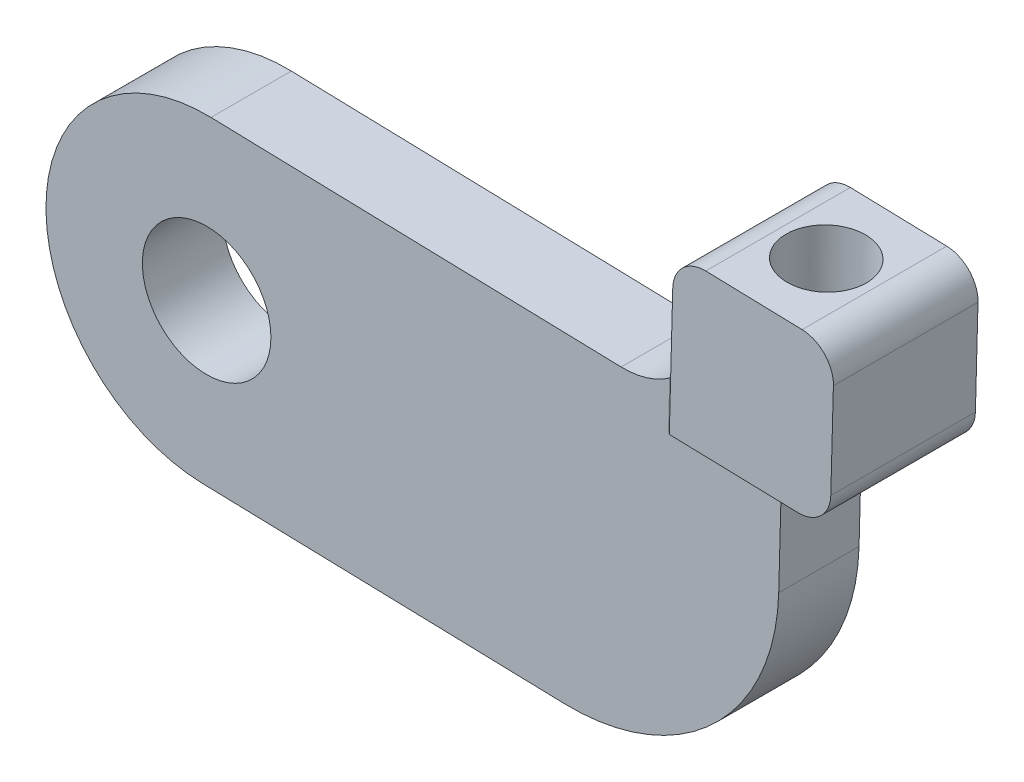
ISO-10303-21;
HEADER;
FILE_DESCRIPTION(('STEP AP214'),'2;1');
FILE_NAME('part.step','',(''),(''),'','','');
FILE_SCHEMA(('AUTOMOTIVE_DESIGN { 1 0 10303 214 1 1 1 1 }'));
ENDSEC;
DATA;
#1=APPLICATION_CONTEXT('core data for automotive mechanical design processes');
#2=APPLICATION_PROTOCOL_DEFINITION('international standard','automotive_design',2000,#1);
#3=PRODUCT_CONTEXT('',#1,'mechanical');
#4=PRODUCT('Part','Part','',(#3));
#5=PRODUCT_RELATED_PRODUCT_CATEGORY('part','',(#4));
#6=PRODUCT_DEFINITION_FORMATION('','',#4);
#7=PRODUCT_DEFINITION_CONTEXT('part definition',#1,'design');
#8=PRODUCT_DEFINITION('design','',#6,#7);
#9=PRODUCT_DEFINITION_SHAPE('','',#8);
#10=(LENGTH_UNIT() NAMED_UNIT(*) SI_UNIT(.MILLI.,.METRE.));
#11=(NAMED_UNIT(*) PLANE_ANGLE_UNIT() SI_UNIT($,.RADIAN.));
#12=(NAMED_UNIT(*) SI_UNIT($,.STERADIAN.) SOLID_ANGLE_UNIT());
#13=UNCERTAINTY_MEASURE_WITH_UNIT(LENGTH_MEASURE(1.E-05),#10,'distance_accuracy_value','');
#14=(GEOMETRIC_REPRESENTATION_CONTEXT(3) GLOBAL_UNCERTAINTY_ASSIGNED_CONTEXT((#13)) GLOBAL_UNIT_ASSIGNED_CONTEXT((#10,
#11,#12)) REPRESENTATION_CONTEXT('',''));
#15=CARTESIAN_POINT('',(0.,0.,0.));
#16=DIRECTION('',(0.,0.,1.));
#17=DIRECTION('',(1.,0.,0.));
#18=AXIS2_PLACEMENT_3D('',#15,#16,#17);
#19=CARTESIAN_POINT('',(-22.2307196296962,10.6024743672487,5.));
#20=DIRECTION('',(-0.0269280370303847,-0.999637374662277,0.));
#21=DIRECTION('',(0.999637374662277,-0.0269280370303847,0.));
#22=AXIS2_PLACEMENT_3D('',#19,#20,#21);
#23=PLANE('',#22);
#24=DIRECTION('',(-0.999637374662277,0.0269280370303847,0.));
#25=VECTOR('',#24,1.);
#26=CARTESIAN_POINT('',(-22.2307196296962,10.6024743672487,5.));
#27=LINE('',#26,#25);
#28=CARTESIAN_POINT('',(3.29446872584462,9.9148818115204,5.));
#29=VERTEX_POINT('',#28);
#30=CARTESIAN_POINT('',(-22.2307196296962,10.6024743672487,5.));
#31=VERTEX_POINT('',#30);
#32=EDGE_CURVE('E292',#29,#31,#27,.T.);
#33=ORIENTED_EDGE('',*,*,#32,.F.);
#34=DIRECTION('',(0.,0.,1.));
#35=VECTOR('',#34,1.);
#36=CARTESIAN_POINT('',(3.29446872584462,9.9148818115204,0.));
#37=LINE('',#36,#35);
#38=CARTESIAN_POINT('',(3.29446872584462,9.9148818115204,0.));
#39=VERTEX_POINT('',#38);
#40=EDGE_CURVE('E313',#29,#39,#37,.F.);
#41=ORIENTED_EDGE('',*,*,#40,.T.);
#42=DIRECTION('',(-0.999637374662277,0.0269280370303847,0.));
#43=VECTOR('',#42,1.);
#44=CARTESIAN_POINT('',(-22.2307196296962,10.6024743672487,0.));
#45=LINE('',#44,#43);
#46=CARTESIAN_POINT('',(-22.2307196296962,10.6024743672487,0.));
#47=VERTEX_POINT('',#46);
#48=EDGE_CURVE('E286',#39,#47,#45,.T.);
#49=ORIENTED_EDGE('',*,*,#48,.T.);
#50=DIRECTION('',(0.,0.,-1.));
#51=VECTOR('',#50,1.);
#52=CARTESIAN_POINT('',(-22.2307196296962,10.6024743672487,5.));
#53=LINE('',#52,#51);
#54=EDGE_CURVE('E280',#31,#47,#53,.T.);
#55=ORIENTED_EDGE('',*,*,#54,.F.);
#56=EDGE_LOOP('',(#33,#41,#49,#55));
#57=FACE_BOUND('',#56,.T.);
#58=ADVANCED_FACE('F33',(#57),#23,.F.);
#59=CARTESIAN_POINT('',(-22.5,0.606100620625907,5.));
#60=DIRECTION('',(0.,0.,1.));
#61=DIRECTION('',(1.,0.,0.));
#62=AXIS2_PLACEMENT_3D('',#59,#60,#61);
#63=PLANE('',#62);
#64=DIRECTION('',(-0.999637374662277,0.0269280370303847,0.));
#65=VECTOR('',#64,1.);
#66=CARTESIAN_POINT('',(8.23879952509524,7.78096687704393,5.));
#67=LINE('',#66,#65);
#68=CARTESIAN_POINT('',(13.2369863984066,7.64632669189201,5.));
#69=VERTEX_POINT('',#68);
#70=CARTESIAN_POINT('',(6.23952477577068,7.8348229511047,5.));
#71=VERTEX_POINT('',#70);
#72=EDGE_CURVE('E324',#69,#71,#67,.T.);
#73=ORIENTED_EDGE('',*,*,#72,.T.);
#74=DIRECTION('',(-0.0269280370303847,-0.999637374662278,0.));
#75=VECTOR('',#74,1.);
#76=CARTESIAN_POINT('',(6.0241004795276,-0.162276046193529,5.));
#77=LINE('',#76,#75);
#78=CARTESIAN_POINT('',(6.32030888686184,10.8337350750915,5.));
#79=VERTEX_POINT('',#78);
#80=EDGE_CURVE('E326',#71,#79,#77,.F.);
#81=ORIENTED_EDGE('',*,*,#80,.T.);
#82=CARTESIAN_POINT('',(3.42910891099654,14.9130686848318,5.));
#83=DIRECTION('',(0.,0.,1.));
#84=DIRECTION('',(1.,0.,0.));
#85=AXIS2_PLACEMENT_3D('',#82,#83,#84);
#86=CIRCLE('',#85,5.);
#87=EDGE_CURVE('E315',#79,#29,#86,.F.);
#88=ORIENTED_EDGE('',*,*,#87,.T.);
#89=ORIENTED_EDGE('',*,*,#32,.T.);
#90=CARTESIAN_POINT('',(-22.5,0.606100620625907,5.));
#91=DIRECTION('',(0.,0.,1.));
#92=DIRECTION('',(1.,0.,0.));
#93=AXIS2_PLACEMENT_3D('',#90,#91,#92);
#94=CIRCLE('',#93,10.);
#95=CARTESIAN_POINT('',(-22.7692803703038,-9.39027312599687,5.));
#96=VERTEX_POINT('',#95);
#97=EDGE_CURVE('E296',#31,#96,#94,.T.);
#98=ORIENTED_EDGE('',*,*,#97,.T.);
#99=DIRECTION('',(0.999637374662277,-0.0269280370303846,0.));
#100=VECTOR('',#99,1.);
#101=CARTESIAN_POINT('',(-22.7692803703038,-9.39027312599687,5.));
#102=LINE('',#101,#100);
#103=CARTESIAN_POINT('',(-0.243004138749909,-9.99708157063399,5.));
#104=VERTEX_POINT('',#103);
#105=EDGE_CURVE('E381',#96,#104,#102,.T.);
#106=ORIENTED_EDGE('',*,*,#105,.T.);
#107=CARTESIAN_POINT('',(0.107060342645095,2.99820429997561,5.));
#108=DIRECTION('',(0.,0.,1.));
#109=DIRECTION('',(1.,0.,0.));
#110=AXIS2_PLACEMENT_3D('',#107,#108,#109);
#111=CIRCLE('',#110,13.);
#112=CARTESIAN_POINT('',(13.1023462132547,2.64813981858061,5.));
#113=VERTEX_POINT('',#112);
#114=EDGE_CURVE('E302',#104,#113,#111,.T.);
#115=ORIENTED_EDGE('',*,*,#114,.T.);
#116=DIRECTION('',(-0.0269280370303847,-0.999637374662277,0.));
#117=VECTOR('',#116,1.);
#118=CARTESIAN_POINT('',(13.0215621021635,-0.350772305406222,5.));
#119=LINE('',#118,#117);
#120=EDGE_CURVE('E376',#69,#113,#119,.T.);
#121=ORIENTED_EDGE('',*,*,#120,.F.);
#122=EDGE_LOOP('',(#73,#81,#88,#89,#98,#106,#115,#121));
#123=FACE_BOUND('',#122,.T.);
#124=CARTESIAN_POINT('',(-22.5,0.606100620625907,5.));
#125=DIRECTION('',(0.,0.,1.));
#126=DIRECTION('',(1.,0.,0.));
#127=AXIS2_PLACEMENT_3D('',#124,#125,#126);
#128=CIRCLE('',#127,4.);
#129=CARTESIAN_POINT('',(-18.5,0.606100620625907,5.));
#130=VERTEX_POINT('',#129);
#131=EDGE_CURVE('E283',#130,#130,#128,.T.);
#132=ORIENTED_EDGE('',*,*,#131,.F.);
#133=EDGE_LOOP('',(#132));
#134=FACE_BOUND('',#133,.T.);
#135=ADVANCED_FACE('F245',(#123,#134),#63,.T.);
#136=CARTESIAN_POINT('',(-22.5,0.606100620625907,0.));
#137=DIRECTION('',(0.,0.,1.));
#138=DIRECTION('',(1.,0.,0.));
#139=AXIS2_PLACEMENT_3D('',#136,#137,#138);
#140=PLANE('',#139);
#141=CARTESIAN_POINT('',(3.42910891099654,14.9130686848318,0.));
#142=DIRECTION('',(0.,0.,1.));
#143=DIRECTION('',(1.,0.,0.));
#144=AXIS2_PLACEMENT_3D('',#141,#142,#143);
#145=CIRCLE('',#144,5.);
#146=CARTESIAN_POINT('',(6.32030888686184,10.8337350750915,0.));
#147=VERTEX_POINT('',#146);
#148=EDGE_CURVE('E317',#39,#147,#145,.T.);
#149=ORIENTED_EDGE('',*,*,#148,.T.);
#150=DIRECTION('',(0.0269280370303847,0.999637374662278,0.));
#151=VECTOR('',#150,1.);
#152=CARTESIAN_POINT('',(6.29338084983145,9.83409770042924,0.));
#153=LINE('',#152,#151);
#154=CARTESIAN_POINT('',(6.23952477577068,7.8348229511047,0.));
#155=VERTEX_POINT('',#154);
#156=EDGE_CURVE('E338',#147,#155,#153,.F.);
#157=ORIENTED_EDGE('',*,*,#156,.T.);
#158=DIRECTION('',(-0.999637374662277,0.0269280370303847,0.));
#159=VECTOR('',#158,1.);
#160=CARTESIAN_POINT('',(-22.2845757037569,8.60319961792414,0.));
#161=LINE('',#160,#159);
#162=CARTESIAN_POINT('',(13.2369863984066,7.64632669189201,0.));
#163=VERTEX_POINT('',#162);
#164=EDGE_CURVE('E337',#155,#163,#161,.F.);
#165=ORIENTED_EDGE('',*,*,#164,.T.);
#166=DIRECTION('',(-0.0269280370303847,-0.999637374662277,0.));
#167=VECTOR('',#166,1.);
#168=CARTESIAN_POINT('',(13.0215621021635,-0.350772305406222,0.));
#169=LINE('',#168,#167);
#170=CARTESIAN_POINT('',(13.1023462132547,2.64813981858061,0.));
#171=VERTEX_POINT('',#170);
#172=EDGE_CURVE('E190',#163,#171,#169,.T.);
#173=ORIENTED_EDGE('',*,*,#172,.T.);
#174=CARTESIAN_POINT('',(0.107060342645095,2.99820429997561,0.));
#175=DIRECTION('',(0.,0.,1.));
#176=DIRECTION('',(1.,0.,0.));
#177=AXIS2_PLACEMENT_3D('',#174,#175,#176);
#178=CIRCLE('',#177,13.);
#179=CARTESIAN_POINT('',(-0.243004138749909,-9.99708157063399,0.));
#180=VERTEX_POINT('',#179);
#181=EDGE_CURVE('E308',#171,#180,#178,.F.);
#182=ORIENTED_EDGE('',*,*,#181,.T.);
#183=DIRECTION('',(0.999637374662277,-0.0269280370303846,0.));
#184=VECTOR('',#183,1.);
#185=CARTESIAN_POINT('',(-22.7692803703038,-9.39027312599687,0.));
#186=LINE('',#185,#184);
#187=CARTESIAN_POINT('',(-22.7692803703038,-9.39027312599687,0.));
#188=VERTEX_POINT('',#187);
#189=EDGE_CURVE('E282',#188,#180,#186,.T.);
#190=ORIENTED_EDGE('',*,*,#189,.F.);
#191=CARTESIAN_POINT('',(-22.5,0.606100620625907,0.));
#192=DIRECTION('',(0.,0.,1.));
#193=DIRECTION('',(1.,0.,0.));
#194=AXIS2_PLACEMENT_3D('',#191,#192,#193);
#195=CIRCLE('',#194,10.);
#196=EDGE_CURVE('E275',#47,#188,#195,.T.);
#197=ORIENTED_EDGE('',*,*,#196,.F.);
#198=ORIENTED_EDGE('',*,*,#48,.F.);
#199=EDGE_LOOP('',(#149,#157,#165,#173,#182,#190,#197,#198));
#200=FACE_BOUND('',#199,.T.);
#201=CARTESIAN_POINT('',(-22.5,0.606100620625907,0.));
#202=DIRECTION('',(0.,0.,1.));
#203=DIRECTION('',(1.,0.,0.));
#204=AXIS2_PLACEMENT_3D('',#201,#202,#203);
#205=CIRCLE('',#204,4.);
#206=CARTESIAN_POINT('',(-18.5,0.606100620625907,0.));
#207=VERTEX_POINT('',#206);
#208=EDGE_CURVE('E289',#207,#207,#205,.T.);
#209=ORIENTED_EDGE('',*,*,#208,.T.);
#210=EDGE_LOOP('',(#209));
#211=FACE_BOUND('',#210,.T.);
#212=ADVANCED_FACE('F252',(#200,#211),#140,.F.);
#213=CARTESIAN_POINT('',(-22.5,0.606100620625907,5.));
#214=DIRECTION('',(0.,0.,-1.));
#215=DIRECTION('',(-1.,0.,0.));
#216=AXIS2_PLACEMENT_3D('',#213,#214,#215);
#217=CYLINDRICAL_SURFACE('',#216,10.);
#218=ORIENTED_EDGE('',*,*,#196,.T.);
#219=DIRECTION('',(0.,0.,-1.));
#220=VECTOR('',#219,1.);
#221=CARTESIAN_POINT('',(-22.7692803703038,-9.39027312599687,5.));
#222=LINE('',#221,#220);
#223=EDGE_CURVE('E278',#96,#188,#222,.T.);
#224=ORIENTED_EDGE('',*,*,#223,.F.);
#225=ORIENTED_EDGE('',*,*,#97,.F.);
#226=ORIENTED_EDGE('',*,*,#54,.T.);
#227=EDGE_LOOP('',(#218,#224,#225,#226));
#228=FACE_BOUND('',#227,.T.);
#229=ADVANCED_FACE('F261',(#228),#217,.T.);
#230=CARTESIAN_POINT('',(-22.7692803703038,-9.39027312599687,5.));
#231=DIRECTION('',(0.0269280370303847,0.999637374662277,0.));
#232=DIRECTION('',(-0.999637374662278,0.0269280370303847,0.));
#233=AXIS2_PLACEMENT_3D('',#230,#231,#232);
#234=PLANE('',#233);
#235=ORIENTED_EDGE('',*,*,#189,.T.);
#236=DIRECTION('',(0.,0.,1.));
#237=VECTOR('',#236,1.);
#238=CARTESIAN_POINT('',(-0.243004138749905,-9.99708157063399,5.));
#239=LINE('',#238,#237);
#240=EDGE_CURVE('E299',#180,#104,#239,.T.);
#241=ORIENTED_EDGE('',*,*,#240,.T.);
#242=ORIENTED_EDGE('',*,*,#105,.F.);
#243=ORIENTED_EDGE('',*,*,#223,.T.);
#244=EDGE_LOOP('',(#235,#241,#242,#243));
#245=FACE_BOUND('',#244,.T.);
#246=ADVANCED_FACE('F258',(#245),#234,.F.);
#247=CARTESIAN_POINT('',(-22.5,0.606100620625907,5.));
#248=DIRECTION('',(0.,0.,-1.));
#249=DIRECTION('',(-1.,0.,0.));
#250=AXIS2_PLACEMENT_3D('',#247,#248,#249);
#251=CYLINDRICAL_SURFACE('',#250,4.);
#252=ORIENTED_EDGE('',*,*,#131,.T.);
#253=EDGE_LOOP('',(#252));
#254=FACE_BOUND('',#253,.T.);
#255=ORIENTED_EDGE('',*,*,#208,.F.);
#256=EDGE_LOOP('',(#255));
#257=FACE_BOUND('',#256,.T.);
#258=ADVANCED_FACE('F260',(#254,#257),#251,.F.);
#259=CARTESIAN_POINT('',(12.7124978249379,-11.8240260869256,14.9723686240009));
#260=DIRECTION('',(-0.999637374662277,0.0269280370303847,0.));
#261=DIRECTION('',(-0.0269280370303847,-0.999637374662277,0.));
#262=AXIS2_PLACEMENT_3D('',#259,#260,#261);
#263=PLANE('',#262);
#264=ORIENTED_EDGE('',*,*,#172,.F.);
#265=DIRECTION('',(0.,0.,-1.));
#266=VECTOR('',#265,1.);
#267=CARTESIAN_POINT('',(13.2369863984066,7.64632669189201,14.9723686240009));
#268=LINE('',#267,#266);
#269=EDGE_CURVE('E335',#163,#69,#268,.F.);
#270=ORIENTED_EDGE('',*,*,#269,.T.);
#271=ORIENTED_EDGE('',*,*,#120,.T.);
#272=DIRECTION('',(0.,0.,1.));
#273=VECTOR('',#272,1.);
#274=CARTESIAN_POINT('',(13.1023462132547,2.64813981858061,14.9723686240009));
#275=LINE('',#274,#273);
#276=EDGE_CURVE('E305',#113,#171,#275,.F.);
#277=ORIENTED_EDGE('',*,*,#276,.T.);
#278=EDGE_LOOP('',(#264,#270,#271,#277));
#279=FACE_BOUND('',#278,.T.);
#280=ADVANCED_FACE('F392',(#279),#263,.F.);
#281=CARTESIAN_POINT('',(8.56193596945985,19.7766153729913,10.));
#282=DIRECTION('',(0.999637374662277,-0.0269280370303847,0.));
#283=DIRECTION('',(0.0269280370303847,0.999637374662278,0.));
#284=AXIS2_PLACEMENT_3D('',#281,#282,#283);
#285=PLANE('',#284);
#286=DIRECTION('',(0.,0.,1.));
#287=VECTOR('',#286,1.);
#288=CARTESIAN_POINT('',(8.42729578430793,14.7784284996799,5.));
#289=LINE('',#288,#287);
#290=CARTESIAN_POINT('',(8.42729578430793,14.7784284996799,-2.));
#291=VERTEX_POINT('',#290);
#292=CARTESIAN_POINT('',(8.42729578430793,14.7784284996799,7.));
#293=VERTEX_POINT('',#292);
#294=EDGE_CURVE('E310',#291,#293,#289,.T.);
#295=ORIENTED_EDGE('',*,*,#294,.T.);
#296=DIRECTION('',(0.0269280370303847,0.999637374662278,0.));
#297=VECTOR('',#296,1.);
#298=CARTESIAN_POINT('',(8.56193596945985,19.7766153729913,7.));
#299=LINE('',#298,#297);
#300=CARTESIAN_POINT('',(8.50807989539908,17.7773406236667,7.));
#301=VERTEX_POINT('',#300);
#302=EDGE_CURVE('E352',#293,#301,#299,.T.);
#303=ORIENTED_EDGE('',*,*,#302,.T.);
#304=DIRECTION('',(0.,0.,1.));
#305=VECTOR('',#304,1.);
#306=CARTESIAN_POINT('',(8.50807989539908,17.7773406236667,10.));
#307=LINE('',#306,#305);
#308=CARTESIAN_POINT('',(8.50807989539908,17.7773406236667,-2.));
#309=VERTEX_POINT('',#308);
#310=EDGE_CURVE('E55',#301,#309,#307,.F.);
#311=ORIENTED_EDGE('',*,*,#310,.T.);
#312=DIRECTION('',(-0.0269280370303847,-0.999637374662278,0.));
#313=VECTOR('',#312,1.);
#314=CARTESIAN_POINT('',(8.56193596945985,19.7766153729913,-2.));
#315=LINE('',#314,#313);
#316=EDGE_CURVE('E355',#309,#291,#315,.T.);
#317=ORIENTED_EDGE('',*,*,#316,.T.);
#318=EDGE_LOOP('',(#295,#303,#311,#317));
#319=FACE_BOUND('',#318,.T.);
#320=ADVANCED_FACE('F354',(#319),#285,.F.);
#321=CARTESIAN_POINT('',(18.5583097160826,19.5073350026874,10.));
#322=DIRECTION('',(-0.999637374662277,0.0269280370303847,0.));
#323=DIRECTION('',(-0.0269280370303847,-0.999637374662278,0.));
#324=AXIS2_PLACEMENT_3D('',#321,#322,#323);
#325=PLANE('',#324);
#326=DIRECTION('',(0.,0.,-1.));
#327=VECTOR('',#326,1.);
#328=CARTESIAN_POINT('',(18.5044536420219,17.5080602533629,10.));
#329=LINE('',#328,#327);
#330=CARTESIAN_POINT('',(18.5044536420219,17.5080602533629,-2.));
#331=VERTEX_POINT('',#330);
#332=CARTESIAN_POINT('',(18.5044536420219,17.5080602533629,7.));
#333=VERTEX_POINT('',#332);
#334=EDGE_CURVE('E171',#331,#333,#329,.F.);
#335=ORIENTED_EDGE('',*,*,#334,.T.);
#336=DIRECTION('',(0.0269280370303846,0.999637374662277,0.));
#337=VECTOR('',#336,1.);
#338=CARTESIAN_POINT('',(18.1902412581192,5.84369562936891,7.));
#339=LINE('',#338,#337);
#340=CARTESIAN_POINT('',(18.3428854198395,11.5102360053892,7.));
#341=VERTEX_POINT('',#340);
#342=EDGE_CURVE('E154',#341,#333,#339,.T.);
#343=ORIENTED_EDGE('',*,*,#342,.F.);
#344=DIRECTION('',(0.,0.,-1.));
#345=VECTOR('',#344,1.);
#346=CARTESIAN_POINT('',(18.3428854198395,11.5102360053892,-5.));
#347=LINE('',#346,#345);
#348=CARTESIAN_POINT('',(18.3428854198395,11.5102360053892,-2.));
#349=VERTEX_POINT('',#348);
#350=EDGE_CURVE('E168',#341,#349,#347,.T.);
#351=ORIENTED_EDGE('',*,*,#350,.T.);
#352=DIRECTION('',(-0.0269280370303846,-0.999637374662277,0.));
#353=VECTOR('',#352,1.);
#354=CARTESIAN_POINT('',(18.1902412581192,5.84369562936891,-2.));
#355=LINE('',#354,#353);
#356=EDGE_CURVE('E364',#331,#349,#355,.T.);
#357=ORIENTED_EDGE('',*,*,#356,.F.);
#358=EDGE_LOOP('',(#335,#343,#351,#357));
#359=FACE_BOUND('',#358,.T.);
#360=ADVANCED_FACE('F166',(#359),#325,.F.);
#361=CARTESIAN_POINT('',(0.538560740607694,19.9927474932456,0.));
#362=DIRECTION('',(-0.0269280370303847,-0.999637374662278,0.));
#363=DIRECTION('',(0.999637374662277,-0.0269280370303847,0.));
#364=AXIS2_PLACEMENT_3D('',#361,#362,#363);
#365=PLANE('',#364);
#366=CARTESIAN_POINT('',(13.5601228427712,19.6419751878393,2.5));
#367=DIRECTION('',(0.0269280370303847,0.999637374662277,0.));
#368=DIRECTION('',(-0.999637374662278,0.0269280370303847,0.));
#369=AXIS2_PLACEMENT_3D('',#366,#367,#368);
#370=CIRCLE('',#369,2.5);
#371=CARTESIAN_POINT('',(11.0610294061155,19.7092952804153,2.5));
#372=VERTEX_POINT('',#371);
#373=EDGE_CURVE('E370',#372,#372,#370,.T.);
#374=ORIENTED_EDGE('',*,*,#373,.F.);
#375=EDGE_LOOP('',(#374));
#376=FACE_BOUND('',#375,.T.);
#377=DIRECTION('',(0.,0.,1.));
#378=VECTOR('',#377,1.);
#379=CARTESIAN_POINT('',(10.5612107187844,19.7227592989305,0.));
#380=LINE('',#379,#378);
#381=CARTESIAN_POINT('',(10.5612107187844,19.7227592989305,-2.));
#382=VERTEX_POINT('',#381);
#383=CARTESIAN_POINT('',(10.5612107187844,19.7227592989305,7.));
#384=VERTEX_POINT('',#383);
#385=EDGE_CURVE('E180',#382,#384,#380,.T.);
#386=ORIENTED_EDGE('',*,*,#385,.T.);
#387=DIRECTION('',(0.999637374662277,-0.0269280370303847,0.));
#388=VECTOR('',#387,1.);
#389=CARTESIAN_POINT('',(0.538560740607694,19.9927474932456,7.));
#390=LINE('',#389,#388);
#391=CARTESIAN_POINT('',(16.5590349667581,19.5611910767482,7.));
#392=VERTEX_POINT('',#391);
#393=EDGE_CURVE('E47',#384,#392,#390,.T.);
#394=ORIENTED_EDGE('',*,*,#393,.T.);
#395=DIRECTION('',(0.,0.,-1.));
#396=VECTOR('',#395,1.);
#397=CARTESIAN_POINT('',(16.5590349667581,19.5611910767482,0.));
#398=LINE('',#397,#396);
#399=CARTESIAN_POINT('',(16.5590349667581,19.5611910767482,-2.));
#400=VERTEX_POINT('',#399);
#401=EDGE_CURVE('E176',#392,#400,#398,.T.);
#402=ORIENTED_EDGE('',*,*,#401,.T.);
#403=DIRECTION('',(-0.999637374662277,0.0269280370303847,0.));
#404=VECTOR('',#403,1.);
#405=CARTESIAN_POINT('',(0.538560740607694,19.9927474932456,-2.));
#406=LINE('',#405,#404);
#407=EDGE_CURVE('E359',#400,#382,#406,.T.);
#408=ORIENTED_EDGE('',*,*,#407,.T.);
#409=EDGE_LOOP('',(#386,#394,#402,#408));
#410=FACE_BOUND('',#409,.T.);
#411=ADVANCED_FACE('F412',(#376,#410),#365,.F.);
#412=CARTESIAN_POINT('',(0.269280370303847,9.99637374662279,0.));
#413=DIRECTION('',(-0.0269280370303847,-0.999637374662278,0.));
#414=DIRECTION('',(0.999637374662277,-0.0269280370303847,0.));
#415=AXIS2_PLACEMENT_3D('',#412,#413,#414);
#416=PLANE('',#415);
#417=DIRECTION('',(0.999637374662277,-0.0269280370303847,0.));
#418=VECTOR('',#417,1.);
#419=CARTESIAN_POINT('',(0.269280370303847,9.99637374662279,7.));
#420=LINE('',#419,#418);
#421=CARTESIAN_POINT('',(15.2901172217919,9.59174536715579,7.));
#422=VERTEX_POINT('',#421);
#423=CARTESIAN_POINT('',(16.2897545964542,9.56481733012541,7.));
#424=VERTEX_POINT('',#423);
#425=EDGE_CURVE('E157',#422,#424,#420,.T.);
#426=ORIENTED_EDGE('',*,*,#425,.F.);
#427=DIRECTION('',(0.,0.,-1.));
#428=VECTOR('',#427,1.);
#429=CARTESIAN_POINT('',(15.2901172217919,9.59174536715579,0.));
#430=LINE('',#429,#428);
#431=CARTESIAN_POINT('',(15.2901172217919,9.59174536715579,-2.));
#432=VERTEX_POINT('',#431);
#433=EDGE_CURVE('E330',#422,#432,#430,.T.);
#434=ORIENTED_EDGE('',*,*,#433,.T.);
#435=DIRECTION('',(-0.999637374662277,0.0269280370303847,0.));
#436=VECTOR('',#435,1.);
#437=CARTESIAN_POINT('',(0.269280370303847,9.99637374662279,-2.));
#438=LINE('',#437,#436);
#439=CARTESIAN_POINT('',(16.2897545964542,9.56481733012541,-2.));
#440=VERTEX_POINT('',#439);
#441=EDGE_CURVE('E361',#440,#432,#438,.T.);
#442=ORIENTED_EDGE('',*,*,#441,.F.);
#443=DIRECTION('',(0.,0.,-1.));
#444=VECTOR('',#443,1.);
#445=CARTESIAN_POINT('',(16.2897545964542,9.56481733012541,10.));
#446=LINE('',#445,#444);
#447=EDGE_CURVE('E184',#440,#424,#446,.F.);
#448=ORIENTED_EDGE('',*,*,#447,.T.);
#449=EDGE_LOOP('',(#426,#434,#442,#448));
#450=FACE_BOUND('',#449,.T.);
#451=ADVANCED_FACE('F403',(#450),#416,.T.);
#452=CARTESIAN_POINT('',(0.107060342645095,2.99820429997561,5.));
#453=DIRECTION('',(0.,0.,1.));
#454=DIRECTION('',(1.,0.,0.));
#455=AXIS2_PLACEMENT_3D('',#452,#453,#454);
#456=CYLINDRICAL_SURFACE('',#455,13.);
#457=ORIENTED_EDGE('',*,*,#181,.F.);
#458=ORIENTED_EDGE('',*,*,#276,.F.);
#459=ORIENTED_EDGE('',*,*,#114,.F.);
#460=ORIENTED_EDGE('',*,*,#240,.F.);
#461=EDGE_LOOP('',(#457,#458,#459,#460));
#462=FACE_BOUND('',#461,.T.);
#463=ADVANCED_FACE('F221',(#462),#456,.T.);
#464=CARTESIAN_POINT('',(3.42910891099654,14.9130686848318,10.));
#465=DIRECTION('',(0.,0.,-1.));
#466=DIRECTION('',(-1.,0.,0.));
#467=AXIS2_PLACEMENT_3D('',#464,#465,#466);
#468=CYLINDRICAL_SURFACE('',#467,5.);
#469=ORIENTED_EDGE('',*,*,#148,.F.);
#470=ORIENTED_EDGE('',*,*,#40,.F.);
#471=ORIENTED_EDGE('',*,*,#87,.F.);
#472=CARTESIAN_POINT('',(6.32030888686184,10.8337350750915,5.));
#473=CARTESIAN_POINT('',(6.39007942506733,10.8831661553552,5.00000675972657));
#474=CARTESIAN_POINT('',(6.4585107455214,10.9343722544194,5.00350842796633));
#475=CARTESIAN_POINT('',(6.59219380876327,11.0398157882693,5.01671090290415));
#476=CARTESIAN_POINT('',(6.65745084277493,11.0940478306453,5.02640098440017));
#477=CARTESIAN_POINT('',(6.78392405041035,11.2046701036105,5.05107718728248));
#478=CARTESIAN_POINT('',(6.84517273875163,11.2610349187616,5.06601209046856));
#479=CARTESIAN_POINT('',(6.96414428560695,11.376067753444,5.10052227484143));
#480=CARTESIAN_POINT('',(7.02186505032211,11.4347371074201,5.12010027868032));
#481=CARTESIAN_POINT('',(7.15736770205421,11.5793565435882,5.17244414905785));
#482=CARTESIAN_POINT('',(7.23327371292243,11.6663224353816,5.20728142470639));
#483=CARTESIAN_POINT('',(7.37758750000803,11.8434456874985,5.28360058480637));
#484=CARTESIAN_POINT('',(7.44599340599441,11.9336038364641,5.32508412025499));
#485=CARTESIAN_POINT('',(7.64084762976898,12.2089999453454,5.45811121958219));
#486=CARTESIAN_POINT('',(7.75612802583293,12.3982874413062,5.55789389268572));
#487=CARTESIAN_POINT('',(7.9285923956856,12.7271205554477,5.7402635992436));
#488=CARTESIAN_POINT('',(7.99290891488367,12.8650359958127,5.81935348927538));
#489=CARTESIAN_POINT('',(8.10793230003825,13.1435219309091,5.98279375794198));
#490=CARTESIAN_POINT('',(8.15863317149688,13.2840935660143,6.06714643352453));
#491=CARTESIAN_POINT('',(8.24672771750411,13.5668027507564,6.23931143366009));
#492=CARTESIAN_POINT('',(8.28414885895681,13.7089364339253,6.3271161950796));
#493=CARTESIAN_POINT('',(8.34616979961863,13.9944561934295,6.50503219133356));
#494=CARTESIAN_POINT('',(8.37077370095023,14.1378418541166,6.59514267852839));
#495=CARTESIAN_POINT('',(8.40960058014407,14.442857428242,6.78755478568218));
#496=CARTESIAN_POINT('',(8.4222117770218,14.6046001474533,6.89001488961174));
#497=CARTESIAN_POINT('',(8.42707645489928,14.7704633709461,6.99496050231884));
#498=CARTESIAN_POINT('',(8.42718849876874,14.7744458966266,6.9974802675753));
#499=CARTESIAN_POINT('',(8.42729578430793,14.7784284996799,7.));
#500=B_SPLINE_CURVE_WITH_KNOTS('',3,(#472,#473,#474,#475,#476,#477,#478,#479,#480,#481,#482,
#483,#484,#485,#486,#487,#488,#489,#490,#491,#492,#493,#494,#495,#496,#497,#498,#499),
.UNSPECIFIED.,.F.,.F.,(4,2,2,2,2,2,2,2,2,2,2,2,2,4),(0.,0.256323586120848,0.512204136350885,
0.765652360303662,1.01924957198092,1.38041574025912,1.74167176531572,2.46784096790537,
2.98178501814788,3.4959549705634,4.00905516339225,4.52199103886929,5.09684964624114,
5.1109917890803),.UNSPECIFIED.);
#501=EDGE_CURVE('E207',#79,#293,#500,.T.);
#502=ORIENTED_EDGE('',*,*,#501,.T.);
#503=ORIENTED_EDGE('',*,*,#294,.F.);
#504=CARTESIAN_POINT('',(6.32030888686184,10.8337350750915,0.));
#505=CARTESIAN_POINT('',(6.39007942506733,10.8831661553552,-6.75972656692743E-06));
#506=CARTESIAN_POINT('',(6.4585107455214,10.9343722544194,-0.00350842796633351));
#507=CARTESIAN_POINT('',(6.59219380876329,11.0398157882693,-0.01671090290415));
#508=CARTESIAN_POINT('',(6.65745084277494,11.0940478306453,-0.0264009844001728));
#509=CARTESIAN_POINT('',(6.78392405041036,11.2046701036105,-0.0510771872824787));
#510=CARTESIAN_POINT('',(6.84517273875164,11.2610349187616,-0.0660120904685648));
#511=CARTESIAN_POINT('',(6.96414428560696,11.376067753444,-0.100522274841432));
#512=CARTESIAN_POINT('',(7.02186505032211,11.4347371074201,-0.120100278680316));
#513=CARTESIAN_POINT('',(7.1573677020542,11.5793565435882,-0.172444149057853));
#514=CARTESIAN_POINT('',(7.23327371292242,11.6663224353816,-0.207281424706384));
#515=CARTESIAN_POINT('',(7.37758750000802,11.8434456874984,-0.283600584806369));
#516=CARTESIAN_POINT('',(7.4459934059944,11.9336038364641,-0.32508412025498));
#517=CARTESIAN_POINT('',(7.64084762976898,12.2089999453454,-0.458111219582186));
#518=CARTESIAN_POINT('',(7.75612802583293,12.3982874413062,-0.557893892685719));
#519=CARTESIAN_POINT('',(7.9285923956856,12.7271205554477,-0.740263599243606));
#520=CARTESIAN_POINT('',(7.99290891488367,12.8650359958127,-0.819353489275386));
#521=CARTESIAN_POINT('',(8.10793230003825,13.1435219309092,-0.982793757941976));
#522=CARTESIAN_POINT('',(8.15863317149689,13.2840935660144,-1.06714643352452));
#523=CARTESIAN_POINT('',(8.24672771750411,13.5668027507564,-1.23931143366012));
#524=CARTESIAN_POINT('',(8.28414885895681,13.7089364339252,-1.32711619507967));
#525=CARTESIAN_POINT('',(8.34616979961863,13.9944561934296,-1.5050321913335));
#526=CARTESIAN_POINT('',(8.37077370095024,14.1378418541168,-1.59514267852815));
#527=CARTESIAN_POINT('',(8.40960058014406,14.4428574282418,-1.78755478568245));
#528=CARTESIAN_POINT('',(8.42221177702178,14.6046001474526,-1.89001488961283));
#529=CARTESIAN_POINT('',(8.42707645489928,14.770463370946,-1.9949605023189));
#530=CARTESIAN_POINT('',(8.42718849876874,14.7744458966266,-1.99748026757533));
#531=CARTESIAN_POINT('',(8.42729578430793,14.7784284996799,-2.));
#532=B_SPLINE_CURVE_WITH_KNOTS('',3,(#504,#505,#506,#507,#508,#509,#510,#511,#512,#513,#514,
#515,#516,#517,#518,#519,#520,#521,#522,#523,#524,#525,#526,#527,#528,#529,#530,#531),
.UNSPECIFIED.,.F.,.F.,(4,2,2,2,2,2,2,2,2,2,2,2,2,4),(0.,0.256323586120859,0.512204136350908,
0.765652360303672,1.01924957198093,1.38041574025911,1.7416717653157,2.46784096790537,
2.98178501814788,3.49595497056341,4.00905516339226,4.52199103886929,5.09684964624114,
5.11099178908029),.UNSPECIFIED.);
#533=EDGE_CURVE('E186',#291,#147,#532,.F.);
#534=ORIENTED_EDGE('',*,*,#533,.T.);
#535=EDGE_LOOP('',(#469,#470,#471,#502,#503,#534));
#536=FACE_BOUND('',#535,.T.);
#537=ADVANCED_FACE('F217',(#536),#468,.F.);
#538=CARTESIAN_POINT('',(6.5626612201353,19.830471447052,-2.));
#539=DIRECTION('',(-0.0269280370303847,-0.999637374662278,0.));
#540=DIRECTION('',(0.999637374662277,-0.0269280370303847,0.));
#541=AXIS2_PLACEMENT_3D('',#538,#539,#540);
#542=CYLINDRICAL_SURFACE('',#541,2.);
#543=ORIENTED_EDGE('',*,*,#533,.F.);
#544=DIRECTION('',(0.0269280370303847,0.999637374662278,0.));
#545=VECTOR('',#544,1.);
#546=CARTESIAN_POINT('',(8.42729578430793,14.7784284996799,-2.));
#547=LINE('',#546,#545);
#548=CARTESIAN_POINT('',(8.292655599156,9.78024162636848,-2.));
#549=VERTEX_POINT('',#548);
#550=EDGE_CURVE('E320',#549,#291,#547,.T.);
#551=ORIENTED_EDGE('',*,*,#550,.F.);
#552=CARTESIAN_POINT('',(6.23952477577068,7.8348229511047,-2.));
#553=DIRECTION('',(-0.687809368762986,0.725891363939441,0.));
#554=DIRECTION('',(-0.725891363939441,-0.687809368762986,0.));
#555=AXIS2_PLACEMENT_3D('',#552,#553,#554);
#556=ELLIPSE('',#555,2.82842712474619,2.);
#557=EDGE_CURVE('E187',#155,#549,#556,.T.);
#558=ORIENTED_EDGE('',*,*,#557,.F.);
#559=ORIENTED_EDGE('',*,*,#156,.F.);
#560=EDGE_LOOP('',(#543,#551,#558,#559));
#561=FACE_BOUND('',#560,.T.);
#562=ADVANCED_FACE('F213',(#561),#542,.F.);
#563=CARTESIAN_POINT('',(0.215424296243078,7.99709899729823,-2.));
#564=DIRECTION('',(-0.999637374662277,0.0269280370303847,0.));
#565=DIRECTION('',(-0.0269280370303847,-0.999637374662278,0.));
#566=AXIS2_PLACEMENT_3D('',#563,#564,#565);
#567=CYLINDRICAL_SURFACE('',#566,2.);
#568=ORIENTED_EDGE('',*,*,#557,.T.);
#569=DIRECTION('',(-0.999637374662277,0.0269280370303847,0.));
#570=VECTOR('',#569,1.);
#571=CARTESIAN_POINT('',(0.269280370303847,9.99637374662279,-2.));
#572=LINE('',#571,#570);
#573=EDGE_CURVE('E328',#432,#549,#572,.T.);
#574=ORIENTED_EDGE('',*,*,#573,.F.);
#575=CARTESIAN_POINT('',(15.2362611477312,7.59247061783124,-2.));
#576=DIRECTION('',(-0.706850366351214,0.0190409975882275,-0.707106781186547));
#577=DIRECTION('',(-0.706850366351214,0.0190409975882275,0.707106781186547));
#578=AXIS2_PLACEMENT_3D('',#575,#576,#577);
#579=ELLIPSE('',#578,2.82842712474619,2.);
#580=EDGE_CURVE('E191',#163,#432,#579,.T.);
#581=ORIENTED_EDGE('',*,*,#580,.F.);
#582=ORIENTED_EDGE('',*,*,#164,.F.);
#583=EDGE_LOOP('',(#568,#574,#581,#582));
#584=FACE_BOUND('',#583,.T.);
#585=ADVANCED_FACE('F236',(#584),#567,.F.);
#586=CARTESIAN_POINT('',(15.2362611477312,7.59247061783124,0.));
#587=DIRECTION('',(0.,0.,-1.));
#588=DIRECTION('',(-1.,0.,0.));
#589=AXIS2_PLACEMENT_3D('',#586,#587,#588);
#590=CYLINDRICAL_SURFACE('',#589,2.);
#591=ORIENTED_EDGE('',*,*,#580,.T.);
#592=ORIENTED_EDGE('',*,*,#433,.F.);
#593=CARTESIAN_POINT('',(15.2362611477312,7.59247061783124,7.));
#594=DIRECTION('',(0.706850366351214,-0.0190409975882275,-0.707106781186547));
#595=DIRECTION('',(-0.706850366351214,0.0190409975882275,-0.707106781186547));
#596=AXIS2_PLACEMENT_3D('',#593,#594,#595);
#597=ELLIPSE('',#596,2.82842712474619,2.);
#598=EDGE_CURVE('E194',#69,#422,#597,.T.);
#599=ORIENTED_EDGE('',*,*,#598,.F.);
#600=ORIENTED_EDGE('',*,*,#269,.F.);
#601=EDGE_LOOP('',(#591,#592,#599,#600));
#602=FACE_BOUND('',#601,.T.);
#603=ADVANCED_FACE('F233',(#602),#590,.F.);
#604=CARTESIAN_POINT('',(-22.2845757037569,8.60319961792414,7.));
#605=DIRECTION('',(0.999637374662277,-0.0269280370303847,0.));
#606=DIRECTION('',(0.0269280370303847,0.999637374662278,0.));
#607=AXIS2_PLACEMENT_3D('',#604,#605,#606);
#608=CYLINDRICAL_SURFACE('',#607,2.);
#609=ORIENTED_EDGE('',*,*,#598,.T.);
#610=DIRECTION('',(-0.999637374662277,0.0269280370303847,0.));
#611=VECTOR('',#610,1.);
#612=CARTESIAN_POINT('',(13.2908424724674,9.64560144121656,7.));
#613=LINE('',#612,#611);
#614=CARTESIAN_POINT('',(8.292655599156,9.78024162636848,7.));
#615=VERTEX_POINT('',#614);
#616=EDGE_CURVE('E333',#615,#422,#613,.F.);
#617=ORIENTED_EDGE('',*,*,#616,.F.);
#618=CARTESIAN_POINT('',(6.23952477577067,7.8348229511047,7.));
#619=DIRECTION('',(0.687809368762986,-0.725891363939441,0.));
#620=DIRECTION('',(0.725891363939441,0.687809368762986,0.));
#621=AXIS2_PLACEMENT_3D('',#618,#619,#620);
#622=ELLIPSE('',#621,2.82842712474619,2.);
#623=EDGE_CURVE('E197',#71,#615,#622,.T.);
#624=ORIENTED_EDGE('',*,*,#623,.F.);
#625=ORIENTED_EDGE('',*,*,#72,.F.);
#626=EDGE_LOOP('',(#609,#617,#624,#625));
#627=FACE_BOUND('',#626,.T.);
#628=ADVANCED_FACE('F229',(#627),#608,.F.);
#629=CARTESIAN_POINT('',(6.5626612201353,19.830471447052,7.));
#630=DIRECTION('',(-0.0269280370303847,-0.999637374662278,0.));
#631=DIRECTION('',(0.999637374662277,-0.0269280370303847,0.));
#632=AXIS2_PLACEMENT_3D('',#629,#630,#631);
#633=CYLINDRICAL_SURFACE('',#632,2.);
#634=ORIENTED_EDGE('',*,*,#501,.F.);
#635=ORIENTED_EDGE('',*,*,#80,.F.);
#636=ORIENTED_EDGE('',*,*,#623,.T.);
#637=DIRECTION('',(-0.0269280370303847,-0.999637374662278,0.));
#638=VECTOR('',#637,1.);
#639=CARTESIAN_POINT('',(8.56193596945985,19.7766153729913,7.));
#640=LINE('',#639,#638);
#641=EDGE_CURVE('E322',#293,#615,#640,.T.);
#642=ORIENTED_EDGE('',*,*,#641,.F.);
#643=EDGE_LOOP('',(#634,#635,#636,#642));
#644=FACE_BOUND('',#643,.T.);
#645=ADVANCED_FACE('F224',(#644),#633,.F.);
#646=CARTESIAN_POINT('',(16.343610670515,11.56409207945,10.));
#647=DIRECTION('',(0.,0.,1.));
#648=DIRECTION('',(1.,0.,0.));
#649=AXIS2_PLACEMENT_3D('',#646,#647,#648);
#650=CYLINDRICAL_SURFACE('',#649,2.);
#651=CARTESIAN_POINT('',(16.343610670515,11.56409207945,7.));
#652=DIRECTION('',(0.,0.,-1.));
#653=DIRECTION('',(-1.,0.,0.));
#654=AXIS2_PLACEMENT_3D('',#651,#652,#653);
#655=CIRCLE('',#654,2.);
#656=EDGE_CURVE('E151',#424,#341,#655,.F.);
#657=ORIENTED_EDGE('',*,*,#656,.F.);
#658=ORIENTED_EDGE('',*,*,#447,.F.);
#659=CARTESIAN_POINT('',(16.343610670515,11.56409207945,-2.));
#660=DIRECTION('',(0.,0.,1.));
#661=DIRECTION('',(1.,0.,0.));
#662=AXIS2_PLACEMENT_3D('',#659,#660,#661);
#663=CIRCLE('',#662,2.);
#664=EDGE_CURVE('E174',#349,#440,#663,.F.);
#665=ORIENTED_EDGE('',*,*,#664,.F.);
#666=ORIENTED_EDGE('',*,*,#350,.F.);
#667=EDGE_LOOP('',(#657,#658,#665,#666));
#668=FACE_BOUND('',#667,.T.);
#669=ADVANCED_FACE('F35',(#668),#650,.T.);
#670=CARTESIAN_POINT('',(16.5051788926973,17.5619163274236,0.));
#671=DIRECTION('',(0.,0.,-1.));
#672=DIRECTION('',(-1.,0.,0.));
#673=AXIS2_PLACEMENT_3D('',#670,#671,#672);
#674=CYLINDRICAL_SURFACE('',#673,2.);
#675=CARTESIAN_POINT('',(16.5051788926973,17.5619163274236,7.));
#676=DIRECTION('',(0.,0.,-1.));
#677=DIRECTION('',(-1.,0.,0.));
#678=AXIS2_PLACEMENT_3D('',#675,#676,#677);
#679=CIRCLE('',#678,2.);
#680=EDGE_CURVE('E162',#333,#392,#679,.F.);
#681=ORIENTED_EDGE('',*,*,#680,.F.);
#682=ORIENTED_EDGE('',*,*,#334,.F.);
#683=CARTESIAN_POINT('',(16.5051788926973,17.5619163274236,-2.));
#684=DIRECTION('',(0.,0.,1.));
#685=DIRECTION('',(1.,0.,0.));
#686=AXIS2_PLACEMENT_3D('',#683,#684,#685);
#687=CIRCLE('',#686,2.);
#688=EDGE_CURVE('E358',#400,#331,#687,.F.);
#689=ORIENTED_EDGE('',*,*,#688,.F.);
#690=ORIENTED_EDGE('',*,*,#401,.F.);
#691=EDGE_LOOP('',(#681,#682,#689,#690));
#692=FACE_BOUND('',#691,.T.);
#693=ADVANCED_FACE('F415',(#692),#674,.T.);
#694=CARTESIAN_POINT('',(10.5073546447236,17.7234845496059,0.));
#695=DIRECTION('',(0.,0.,1.));
#696=DIRECTION('',(1.,0.,0.));
#697=AXIS2_PLACEMENT_3D('',#694,#695,#696);
#698=CYLINDRICAL_SURFACE('',#697,2.);
#699=CARTESIAN_POINT('',(10.5073546447236,17.7234845496059,7.));
#700=DIRECTION('',(0.,0.,-1.));
#701=DIRECTION('',(-1.,0.,0.));
#702=AXIS2_PLACEMENT_3D('',#699,#700,#701);
#703=CIRCLE('',#702,2.);
#704=EDGE_CURVE('E11',#384,#301,#703,.F.);
#705=ORIENTED_EDGE('',*,*,#704,.F.);
#706=ORIENTED_EDGE('',*,*,#385,.F.);
#707=CARTESIAN_POINT('',(10.5073546447236,17.7234845496059,-2.));
#708=DIRECTION('',(0.,0.,1.));
#709=DIRECTION('',(1.,0.,0.));
#710=AXIS2_PLACEMENT_3D('',#707,#708,#709);
#711=CIRCLE('',#710,2.);
#712=EDGE_CURVE('E41',#309,#382,#711,.F.);
#713=ORIENTED_EDGE('',*,*,#712,.F.);
#714=ORIENTED_EDGE('',*,*,#310,.F.);
#715=EDGE_LOOP('',(#705,#706,#713,#714));
#716=FACE_BOUND('',#715,.T.);
#717=ADVANCED_FACE('F417',(#716),#698,.T.);
#718=CARTESIAN_POINT('',(13.3716265835585,12.6445135652034,2.5));
#719=DIRECTION('',(0.0269280370303847,0.999637374662277,0.));
#720=DIRECTION('',(-0.999637374662278,0.0269280370303847,0.));
#721=AXIS2_PLACEMENT_3D('',#718,#719,#720);
#722=CYLINDRICAL_SURFACE('',#721,2.5);
#723=CARTESIAN_POINT('',(13.3716265835585,12.6445135652034,2.5));
#724=DIRECTION('',(0.0269280370303847,0.999637374662277,0.));
#725=DIRECTION('',(-0.999637374662278,0.0269280370303847,0.));
#726=AXIS2_PLACEMENT_3D('',#723,#724,#725);
#727=CIRCLE('',#726,2.5);
#728=CARTESIAN_POINT('',(10.8725331469029,12.7118336577794,2.5));
#729=VERTEX_POINT('',#728);
#730=EDGE_CURVE('E200',#729,#729,#727,.T.);
#731=ORIENTED_EDGE('',*,*,#730,.F.);
#732=EDGE_LOOP('',(#731));
#733=FACE_BOUND('',#732,.T.);
#734=ORIENTED_EDGE('',*,*,#373,.T.);
#735=EDGE_LOOP('',(#734));
#736=FACE_BOUND('',#735,.T.);
#737=ADVANCED_FACE('F422',(#733,#736),#722,.F.);
#738=CARTESIAN_POINT('',(13.3716265835585,12.6445135652034,2.5));
#739=DIRECTION('',(0.0269280370303847,0.999637374662277,0.));
#740=DIRECTION('',(-0.999637374662278,0.0269280370303847,0.));
#741=AXIS2_PLACEMENT_3D('',#738,#739,#740);
#742=PLANE('',#741);
#743=ORIENTED_EDGE('',*,*,#730,.T.);
#744=EDGE_LOOP('',(#743));
#745=FACE_BOUND('',#744,.T.);
#746=ADVANCED_FACE('F495',(#745),#742,.T.);
#747=CARTESIAN_POINT('',(-32.8368634707251,7.2182538446976,-2.));
#748=DIRECTION('',(0.,0.,1.));
#749=DIRECTION('',(1.,0.,0.));
#750=AXIS2_PLACEMENT_3D('',#747,#748,#749);
#751=PLANE('',#750);
#752=ORIENTED_EDGE('',*,*,#664,.T.);
#753=ORIENTED_EDGE('',*,*,#441,.T.);
#754=ORIENTED_EDGE('',*,*,#573,.T.);
#755=ORIENTED_EDGE('',*,*,#550,.T.);
#756=ORIENTED_EDGE('',*,*,#316,.F.);
#757=ORIENTED_EDGE('',*,*,#712,.T.);
#758=ORIENTED_EDGE('',*,*,#407,.F.);
#759=ORIENTED_EDGE('',*,*,#688,.T.);
#760=ORIENTED_EDGE('',*,*,#356,.T.);
#761=EDGE_LOOP('',(#752,#753,#754,#755,#756,#757,#758,#759,#760));
#762=FACE_BOUND('',#761,.T.);
#763=ADVANCED_FACE('F404',(#762),#751,.F.);
#764=CARTESIAN_POINT('',(-32.8368634707251,7.2182538446976,7.));
#765=DIRECTION('',(0.,0.,-1.));
#766=DIRECTION('',(-1.,0.,0.));
#767=AXIS2_PLACEMENT_3D('',#764,#765,#766);
#768=PLANE('',#767);
#769=ORIENTED_EDGE('',*,*,#616,.T.);
#770=ORIENTED_EDGE('',*,*,#425,.T.);
#771=ORIENTED_EDGE('',*,*,#656,.T.);
#772=ORIENTED_EDGE('',*,*,#342,.T.);
#773=ORIENTED_EDGE('',*,*,#680,.T.);
#774=ORIENTED_EDGE('',*,*,#393,.F.);
#775=ORIENTED_EDGE('',*,*,#704,.T.);
#776=ORIENTED_EDGE('',*,*,#302,.F.);
#777=ORIENTED_EDGE('',*,*,#641,.T.);
#778=EDGE_LOOP('',(#769,#770,#771,#772,#773,#774,#775,#776,#777));
#779=FACE_BOUND('',#778,.T.);
#780=ADVANCED_FACE('F153',(#779),#768,.F.);
#781=CLOSED_SHELL('',(#58,#135,#212,#229,#246,#258,#280,#320,#360,#411,#451,#463,#537,#562,#585,
#603,#628,#645,#669,#693,#717,#737,#746,#763,#780));
#782=MANIFOLD_SOLID_BREP('B2',#781);
#783=ADVANCED_BREP_SHAPE_REPRESENTATION('',(#18,#782),#14);
#784=SHAPE_DEFINITION_REPRESENTATION(#9,#783);
ENDSEC;
END-ISO-10303-21;
